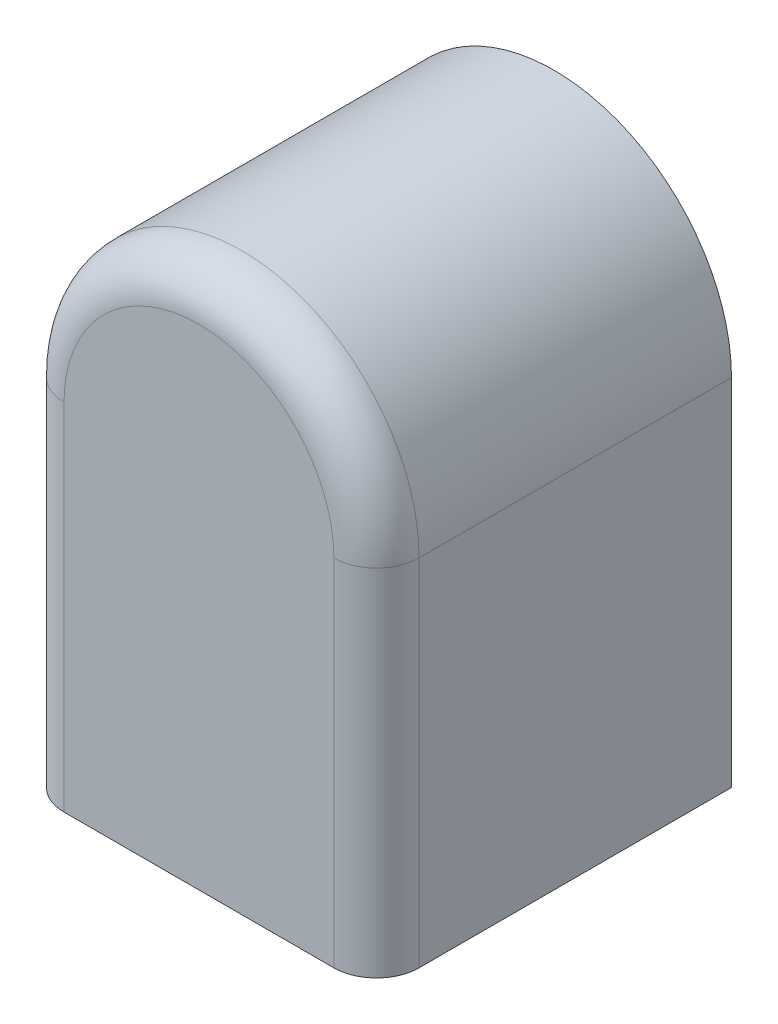
ISO-10303-21;
HEADER;
FILE_DESCRIPTION(('STEP AP214'),'2;1');
FILE_NAME('part.step','',(''),(''),'','','');
FILE_SCHEMA(('AUTOMOTIVE_DESIGN { 1 0 10303 214 1 1 1 1 }'));
ENDSEC;
DATA;
#1=APPLICATION_CONTEXT('core data for automotive mechanical design processes');
#2=APPLICATION_PROTOCOL_DEFINITION('international standard','automotive_design',2000,#1);
#3=PRODUCT_CONTEXT('',#1,'mechanical');
#4=PRODUCT('Part','Part','',(#3));
#5=PRODUCT_RELATED_PRODUCT_CATEGORY('part','',(#4));
#6=PRODUCT_DEFINITION_FORMATION('','',#4);
#7=PRODUCT_DEFINITION_CONTEXT('part definition',#1,'design');
#8=PRODUCT_DEFINITION('design','',#6,#7);
#9=PRODUCT_DEFINITION_SHAPE('','',#8);
#10=(LENGTH_UNIT() NAMED_UNIT(*) SI_UNIT(.MILLI.,.METRE.));
#11=(NAMED_UNIT(*) PLANE_ANGLE_UNIT() SI_UNIT($,.RADIAN.));
#12=(NAMED_UNIT(*) SI_UNIT($,.STERADIAN.) SOLID_ANGLE_UNIT());
#13=UNCERTAINTY_MEASURE_WITH_UNIT(LENGTH_MEASURE(1.E-05),#10,'distance_accuracy_value','');
#14=(GEOMETRIC_REPRESENTATION_CONTEXT(3) GLOBAL_UNCERTAINTY_ASSIGNED_CONTEXT((#13)) GLOBAL_UNIT_ASSIGNED_CONTEXT((#10,
#11,#12)) REPRESENTATION_CONTEXT('',''));
#15=CARTESIAN_POINT('',(0.,0.,0.));
#16=DIRECTION('',(0.,0.,1.));
#17=DIRECTION('',(1.,0.,0.));
#18=AXIS2_PLACEMENT_3D('',#15,#16,#17);
#19=CARTESIAN_POINT('',(0.,0.,25.));
#20=DIRECTION('',(0.,0.,-1.));
#21=DIRECTION('',(-1.,0.,0.));
#22=AXIS2_PLACEMENT_3D('',#19,#20,#21);
#23=CYLINDRICAL_SURFACE('',#22,12.5);
#24=DIRECTION('',(0.,0.,-1.));
#25=VECTOR('',#24,1.);
#26=CARTESIAN_POINT('',(-12.5,0.,25.));
#27=LINE('',#26,#25);
#28=CARTESIAN_POINT('',(-12.5,0.,22.));
#29=VERTEX_POINT('',#28);
#30=CARTESIAN_POINT('',(-12.5,0.,0.));
#31=VERTEX_POINT('',#30);
#32=EDGE_CURVE('E85',#29,#31,#27,.T.);
#33=ORIENTED_EDGE('',*,*,#32,.F.);
#34=CARTESIAN_POINT('',(0.,0.,22.));
#35=DIRECTION('',(0.,0.,1.));
#36=DIRECTION('',(1.,0.,0.));
#37=AXIS2_PLACEMENT_3D('',#34,#35,#36);
#38=CIRCLE('',#37,12.5);
#39=CARTESIAN_POINT('',(12.5,0.,22.));
#40=VERTEX_POINT('',#39);
#41=EDGE_CURVE('E11',#29,#40,#38,.F.);
#42=ORIENTED_EDGE('',*,*,#41,.T.);
#43=DIRECTION('',(0.,0.,-1.));
#44=VECTOR('',#43,1.);
#45=CARTESIAN_POINT('',(12.5,0.,25.));
#46=LINE('',#45,#44);
#47=CARTESIAN_POINT('',(12.5,0.,0.));
#48=VERTEX_POINT('',#47);
#49=EDGE_CURVE('E105',#40,#48,#46,.T.);
#50=ORIENTED_EDGE('',*,*,#49,.T.);
#51=CARTESIAN_POINT('',(0.,0.,0.));
#52=DIRECTION('',(0.,0.,1.));
#53=DIRECTION('',(1.,0.,0.));
#54=AXIS2_PLACEMENT_3D('',#51,#52,#53);
#55=CIRCLE('',#54,12.5);
#56=EDGE_CURVE('E100',#48,#31,#55,.T.);
#57=ORIENTED_EDGE('',*,*,#56,.T.);
#58=EDGE_LOOP('',(#33,#42,#50,#57));
#59=FACE_BOUND('',#58,.T.);
#60=ADVANCED_FACE('F33',(#59),#23,.T.);
#61=CARTESIAN_POINT('',(-12.5,0.,25.));
#62=DIRECTION('',(1.,0.,0.));
#63=DIRECTION('',(0.,0.,-1.));
#64=AXIS2_PLACEMENT_3D('',#61,#62,#63);
#65=PLANE('',#64);
#66=DIRECTION('',(0.,0.,-1.));
#67=VECTOR('',#66,1.);
#68=CARTESIAN_POINT('',(-12.5,-25.,25.));
#69=LINE('',#68,#67);
#70=CARTESIAN_POINT('',(-12.5,-25.,22.));
#71=VERTEX_POINT('',#70);
#72=CARTESIAN_POINT('',(-12.5,-25.,0.));
#73=VERTEX_POINT('',#72);
#74=EDGE_CURVE('E94',#71,#73,#69,.T.);
#75=ORIENTED_EDGE('',*,*,#74,.F.);
#76=DIRECTION('',(0.,-1.,0.));
#77=VECTOR('',#76,1.);
#78=CARTESIAN_POINT('',(-12.5,0.,22.));
#79=LINE('',#78,#77);
#80=EDGE_CURVE('E42',#71,#29,#79,.F.);
#81=ORIENTED_EDGE('',*,*,#80,.T.);
#82=ORIENTED_EDGE('',*,*,#32,.T.);
#83=DIRECTION('',(0.,-1.,0.));
#84=VECTOR('',#83,1.);
#85=CARTESIAN_POINT('',(-12.5,0.,0.));
#86=LINE('',#85,#84);
#87=EDGE_CURVE('E88',#31,#73,#86,.T.);
#88=ORIENTED_EDGE('',*,*,#87,.T.);
#89=EDGE_LOOP('',(#75,#81,#82,#88));
#90=FACE_BOUND('',#89,.T.);
#91=ADVANCED_FACE('F87',(#90),#65,.F.);
#92=CARTESIAN_POINT('',(-12.5,-25.,25.));
#93=DIRECTION('',(0.,1.,0.));
#94=DIRECTION('',(0.,0.,1.));
#95=AXIS2_PLACEMENT_3D('',#92,#93,#94);
#96=PLANE('',#95);
#97=DIRECTION('',(0.,0.,-1.));
#98=VECTOR('',#97,1.);
#99=CARTESIAN_POINT('',(12.5,-25.,25.));
#100=LINE('',#99,#98);
#101=CARTESIAN_POINT('',(12.5,-25.,22.));
#102=VERTEX_POINT('',#101);
#103=CARTESIAN_POINT('',(12.5,-25.,0.));
#104=VERTEX_POINT('',#103);
#105=EDGE_CURVE('E117',#102,#104,#100,.T.);
#106=ORIENTED_EDGE('',*,*,#105,.F.);
#107=CARTESIAN_POINT('',(9.5,-25.,22.));
#108=DIRECTION('',(0.,1.,0.));
#109=DIRECTION('',(0.,0.,1.));
#110=AXIS2_PLACEMENT_3D('',#107,#108,#109);
#111=CIRCLE('',#110,3.);
#112=CARTESIAN_POINT('',(9.5,-25.,25.));
#113=VERTEX_POINT('',#112);
#114=EDGE_CURVE('E129',#102,#113,#111,.F.);
#115=ORIENTED_EDGE('',*,*,#114,.T.);
#116=DIRECTION('',(1.,0.,0.));
#117=VECTOR('',#116,1.);
#118=CARTESIAN_POINT('',(-12.5,-25.,25.));
#119=LINE('',#118,#117);
#120=CARTESIAN_POINT('',(-9.5,-25.,25.));
#121=VERTEX_POINT('',#120);
#122=EDGE_CURVE('E111',#121,#113,#119,.T.);
#123=ORIENTED_EDGE('',*,*,#122,.F.);
#124=CARTESIAN_POINT('',(-9.5,-25.,22.));
#125=DIRECTION('',(0.,1.,0.));
#126=DIRECTION('',(0.,0.,1.));
#127=AXIS2_PLACEMENT_3D('',#124,#125,#126);
#128=CIRCLE('',#127,3.);
#129=EDGE_CURVE('E57',#121,#71,#128,.F.);
#130=ORIENTED_EDGE('',*,*,#129,.T.);
#131=ORIENTED_EDGE('',*,*,#74,.T.);
#132=DIRECTION('',(1.,0.,0.));
#133=VECTOR('',#132,1.);
#134=CARTESIAN_POINT('',(-12.5,-25.,0.));
#135=LINE('',#134,#133);
#136=EDGE_CURVE('E102',#73,#104,#135,.T.);
#137=ORIENTED_EDGE('',*,*,#136,.T.);
#138=EDGE_LOOP('',(#106,#115,#123,#130,#131,#137));
#139=FACE_BOUND('',#138,.T.);
#140=ADVANCED_FACE('F146',(#139),#96,.F.);
#141=CARTESIAN_POINT('',(12.5,-25.,25.));
#142=DIRECTION('',(-1.,0.,0.));
#143=DIRECTION('',(0.,0.,1.));
#144=AXIS2_PLACEMENT_3D('',#141,#142,#143);
#145=PLANE('',#144);
#146=ORIENTED_EDGE('',*,*,#49,.F.);
#147=DIRECTION('',(0.,1.,0.));
#148=VECTOR('',#147,1.);
#149=CARTESIAN_POINT('',(12.5,-25.,22.));
#150=LINE('',#149,#148);
#151=EDGE_CURVE('E126',#40,#102,#150,.F.);
#152=ORIENTED_EDGE('',*,*,#151,.T.);
#153=ORIENTED_EDGE('',*,*,#105,.T.);
#154=DIRECTION('',(0.,1.,0.));
#155=VECTOR('',#154,1.);
#156=CARTESIAN_POINT('',(12.5,-25.,0.));
#157=LINE('',#156,#155);
#158=EDGE_CURVE('E114',#104,#48,#157,.T.);
#159=ORIENTED_EDGE('',*,*,#158,.T.);
#160=EDGE_LOOP('',(#146,#152,#153,#159));
#161=FACE_BOUND('',#160,.T.);
#162=ADVANCED_FACE('F149',(#161),#145,.F.);
#163=CARTESIAN_POINT('',(0.,0.,25.));
#164=DIRECTION('',(0.,0.,1.));
#165=DIRECTION('',(1.,0.,0.));
#166=AXIS2_PLACEMENT_3D('',#163,#164,#165);
#167=PLANE('',#166);
#168=ORIENTED_EDGE('',*,*,#122,.T.);
#169=DIRECTION('',(0.,1.,0.));
#170=VECTOR('',#169,1.);
#171=CARTESIAN_POINT('',(9.5,0.,25.));
#172=LINE('',#171,#170);
#173=CARTESIAN_POINT('',(9.5,0.,25.));
#174=VERTEX_POINT('',#173);
#175=EDGE_CURVE('E123',#113,#174,#172,.T.);
#176=ORIENTED_EDGE('',*,*,#175,.T.);
#177=CARTESIAN_POINT('',(0.,0.,25.));
#178=DIRECTION('',(0.,0.,1.));
#179=DIRECTION('',(1.,0.,0.));
#180=AXIS2_PLACEMENT_3D('',#177,#178,#179);
#181=CIRCLE('',#180,9.5);
#182=CARTESIAN_POINT('',(-9.5,0.,25.));
#183=VERTEX_POINT('',#182);
#184=EDGE_CURVE('E93',#174,#183,#181,.T.);
#185=ORIENTED_EDGE('',*,*,#184,.T.);
#186=DIRECTION('',(0.,-1.,0.));
#187=VECTOR('',#186,1.);
#188=CARTESIAN_POINT('',(-9.5,-25.,25.));
#189=LINE('',#188,#187);
#190=EDGE_CURVE('E121',#183,#121,#189,.T.);
#191=ORIENTED_EDGE('',*,*,#190,.T.);
#192=EDGE_LOOP('',(#168,#176,#185,#191));
#193=FACE_BOUND('',#192,.T.);
#194=ADVANCED_FACE('F144',(#193),#167,.T.);
#195=CARTESIAN_POINT('',(0.,0.,0.));
#196=DIRECTION('',(0.,0.,1.));
#197=DIRECTION('',(1.,0.,0.));
#198=AXIS2_PLACEMENT_3D('',#195,#196,#197);
#199=PLANE('',#198);
#200=ORIENTED_EDGE('',*,*,#56,.F.);
#201=ORIENTED_EDGE('',*,*,#158,.F.);
#202=ORIENTED_EDGE('',*,*,#136,.F.);
#203=ORIENTED_EDGE('',*,*,#87,.F.);
#204=EDGE_LOOP('',(#200,#201,#202,#203));
#205=FACE_BOUND('',#204,.T.);
#206=ADVANCED_FACE('F98',(#205),#199,.F.);
#207=CARTESIAN_POINT('',(-9.5,0.,22.));
#208=DIRECTION('',(0.,1.,0.));
#209=DIRECTION('',(0.,0.,1.));
#210=AXIS2_PLACEMENT_3D('',#207,#208,#209);
#211=CYLINDRICAL_SURFACE('',#210,3.);
#212=ORIENTED_EDGE('',*,*,#129,.F.);
#213=ORIENTED_EDGE('',*,*,#190,.F.);
#214=CARTESIAN_POINT('',(-9.5,0.,22.));
#215=DIRECTION('',(0.,1.,0.));
#216=DIRECTION('',(0.,0.,1.));
#217=AXIS2_PLACEMENT_3D('',#214,#215,#216);
#218=CIRCLE('',#217,3.);
#219=EDGE_CURVE('E37',#29,#183,#218,.T.);
#220=ORIENTED_EDGE('',*,*,#219,.F.);
#221=ORIENTED_EDGE('',*,*,#80,.F.);
#222=EDGE_LOOP('',(#212,#213,#220,#221));
#223=FACE_BOUND('',#222,.T.);
#224=ADVANCED_FACE('F35',(#223),#211,.T.);
#225=CARTESIAN_POINT('',(0.,0.,22.));
#226=DIRECTION('',(0.,0.,1.));
#227=DIRECTION('',(1.,0.,0.));
#228=AXIS2_PLACEMENT_3D('',#225,#226,#227);
#229=TOROIDAL_SURFACE('',#228,9.5,3.);
#230=ORIENTED_EDGE('',*,*,#219,.T.);
#231=ORIENTED_EDGE('',*,*,#184,.F.);
#232=CARTESIAN_POINT('',(9.5,0.,22.));
#233=DIRECTION('',(0.,-1.,0.));
#234=DIRECTION('',(0.,0.,-1.));
#235=AXIS2_PLACEMENT_3D('',#232,#233,#234);
#236=CIRCLE('',#235,3.);
#237=EDGE_CURVE('E109',#40,#174,#236,.T.);
#238=ORIENTED_EDGE('',*,*,#237,.F.);
#239=ORIENTED_EDGE('',*,*,#41,.F.);
#240=EDGE_LOOP('',(#230,#231,#238,#239));
#241=FACE_BOUND('',#240,.T.);
#242=ADVANCED_FACE('F140',(#241),#229,.T.);
#243=CARTESIAN_POINT('',(9.5,0.,22.));
#244=DIRECTION('',(0.,-1.,0.));
#245=DIRECTION('',(0.,0.,-1.));
#246=AXIS2_PLACEMENT_3D('',#243,#244,#245);
#247=CYLINDRICAL_SURFACE('',#246,3.);
#248=ORIENTED_EDGE('',*,*,#114,.F.);
#249=ORIENTED_EDGE('',*,*,#151,.F.);
#250=ORIENTED_EDGE('',*,*,#237,.T.);
#251=ORIENTED_EDGE('',*,*,#175,.F.);
#252=EDGE_LOOP('',(#248,#249,#250,#251));
#253=FACE_BOUND('',#252,.T.);
#254=ADVANCED_FACE('F137',(#253),#247,.T.);
#255=CLOSED_SHELL('',(#60,#91,#140,#162,#194,#206,#224,#242,#254));
#256=MANIFOLD_SOLID_BREP('B2',#255);
#257=ADVANCED_BREP_SHAPE_REPRESENTATION('',(#18,#256),#14);
#258=SHAPE_DEFINITION_REPRESENTATION(#9,#257);
ENDSEC;
END-ISO-10303-21;
